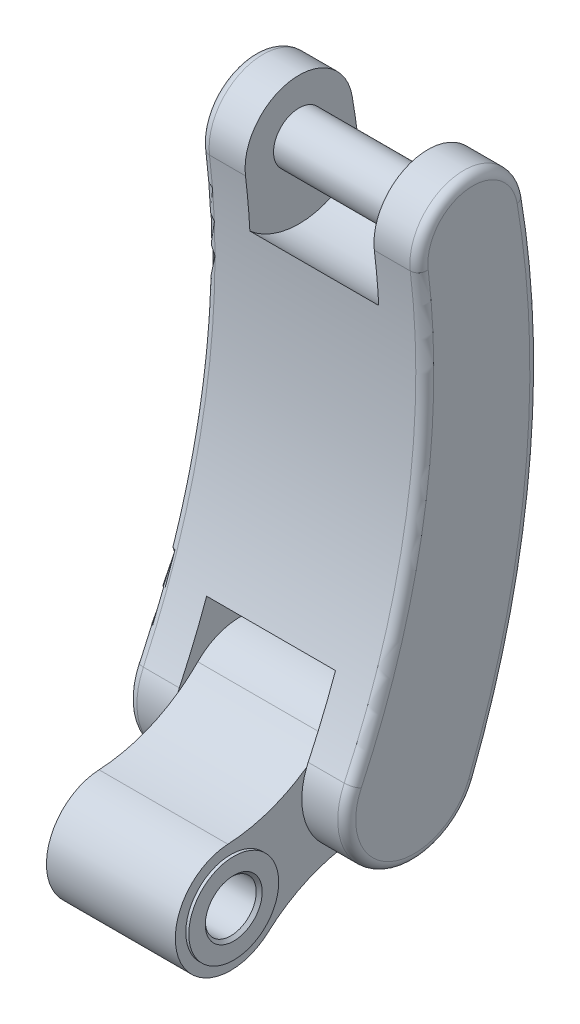
ISO-10303-21;
HEADER;
FILE_DESCRIPTION(('STEP AP214'),'2;1');
FILE_NAME('part.step','',(''),(''),'','','');
FILE_SCHEMA(('AUTOMOTIVE_DESIGN { 1 0 10303 214 1 1 1 1 }'));
ENDSEC;
DATA;
#1=APPLICATION_CONTEXT('core data for automotive mechanical design processes');
#2=APPLICATION_PROTOCOL_DEFINITION('international standard','automotive_design',2000,#1);
#3=PRODUCT_CONTEXT('',#1,'mechanical');
#4=PRODUCT('Part','Part','',(#3));
#5=PRODUCT_RELATED_PRODUCT_CATEGORY('part','',(#4));
#6=PRODUCT_DEFINITION_FORMATION('','',#4);
#7=PRODUCT_DEFINITION_CONTEXT('part definition',#1,'design');
#8=PRODUCT_DEFINITION('design','',#6,#7);
#9=PRODUCT_DEFINITION_SHAPE('','',#8);
#10=(LENGTH_UNIT() NAMED_UNIT(*) SI_UNIT(.MILLI.,.METRE.));
#11=(NAMED_UNIT(*) PLANE_ANGLE_UNIT() SI_UNIT($,.RADIAN.));
#12=(NAMED_UNIT(*) SI_UNIT($,.STERADIAN.) SOLID_ANGLE_UNIT());
#13=UNCERTAINTY_MEASURE_WITH_UNIT(LENGTH_MEASURE(1.E-05),#10,'distance_accuracy_value','');
#14=(GEOMETRIC_REPRESENTATION_CONTEXT(3) GLOBAL_UNCERTAINTY_ASSIGNED_CONTEXT((#13)) GLOBAL_UNIT_ASSIGNED_CONTEXT((#10,
#11,#12)) REPRESENTATION_CONTEXT('',''));
#15=CARTESIAN_POINT('',(0.,0.,0.));
#16=DIRECTION('',(0.,0.,1.));
#17=DIRECTION('',(1.,0.,0.));
#18=AXIS2_PLACEMENT_3D('',#15,#16,#17);
#19=CARTESIAN_POINT('',(-107.5,386.346733479078,385.154372171005));
#20=DIRECTION('',(-1.,0.,0.));
#21=DIRECTION('',(0.,0.,1.));
#22=AXIS2_PLACEMENT_3D('',#19,#20,#21);
#23=PLANE('',#22);
#24=CARTESIAN_POINT('',(-107.5,839.25450412163,-328.864527292864));
#25=DIRECTION('',(-1.,0.,0.));
#26=DIRECTION('',(0.,0.,1.));
#27=AXIS2_PLACEMENT_3D('',#24,#25,#26);
#28=CIRCLE('',#27,42.5000000000001);
#29=CARTESIAN_POINT('',(-107.5,839.25450412163,-371.364527292864));
#30=VERTEX_POINT('',#29);
#31=EDGE_CURVE('E11',#30,#30,#28,.F.);
#32=ORIENTED_EDGE('',*,*,#31,.F.);
#33=EDGE_LOOP('',(#32));
#34=FACE_BOUND('',#33,.T.);
#35=CARTESIAN_POINT('',(-107.5,839.25450412163,-328.864527292864));
#36=DIRECTION('',(-1.,0.,0.));
#37=DIRECTION('',(0.,0.,1.));
#38=AXIS2_PLACEMENT_3D('',#35,#36,#37);
#39=CIRCLE('',#38,125.);
#40=CARTESIAN_POINT('',(-107.5,744.898412841049,-246.877162179386));
#41=VERTEX_POINT('',#40);
#42=CARTESIAN_POINT('',(-107.5,765.815935458155,-430.016772115507));
#43=VERTEX_POINT('',#42);
#44=EDGE_CURVE('E51',#41,#43,#39,.F.);
#45=ORIENTED_EDGE('',*,*,#44,.T.);
#46=CARTESIAN_POINT('',(-107.5,601.669878834398,1060.9748684026));
#47=DIRECTION('',(-1.,0.,0.));
#48=DIRECTION('',(0.,0.,1.));
#49=AXIS2_PLACEMENT_3D('',#46,#47,#48);
#50=CIRCLE('',#49,1500.);
#51=CARTESIAN_POINT('',(-107.5,854.419480203794,-417.577680209595));
#52=VERTEX_POINT('',#51);
#53=EDGE_CURVE('E214',#52,#43,#50,.T.);
#54=ORIENTED_EDGE('',*,*,#53,.F.);
#55=CARTESIAN_POINT('',(-107.5,839.25450412163,-328.864527292864));
#56=DIRECTION('',(-1.,0.,0.));
#57=DIRECTION('',(0.,0.,1.));
#58=AXIS2_PLACEMENT_3D('',#55,#56,#57);
#59=CIRCLE('',#58,90.0000000000002);
#60=CARTESIAN_POINT('',(-107.5,828.358332052281,-239.526554211787));
#61=VERTEX_POINT('',#60);
#62=EDGE_CURVE('E205',#61,#52,#59,.T.);
#63=ORIENTED_EDGE('',*,*,#62,.F.);
#64=CARTESIAN_POINT('',(-107.5,677.022608866883,1001.27862746983));
#65=DIRECTION('',(1.,0.,0.));
#66=DIRECTION('',(0.,0.,1.));
#67=AXIS2_PLACEMENT_3D('',#64,#65,#66);
#68=CIRCLE('',#67,1250.);
#69=EDGE_CURVE('E206',#41,#61,#68,.T.);
#70=ORIENTED_EDGE('',*,*,#69,.F.);
#71=EDGE_LOOP('',(#45,#54,#63,#70));
#72=FACE_BOUND('',#71,.T.);
#73=ADVANCED_FACE('F36',(#34,#72),#23,.F.);
#74=CARTESIAN_POINT('',(-107.5,95.6708580912726,-230.969883127822));
#75=DIRECTION('',(-1.,0.,0.));
#76=DIRECTION('',(0.,0.,1.));
#77=AXIS2_PLACEMENT_3D('',#74,#75,#76);
#78=CIRCLE('',#77,167.5);
#79=CARTESIAN_POINT('',(-107.5,176.700112622026,-377.566301604504));
#80=VERTEX_POINT('',#79);
#81=CARTESIAN_POINT('',(-107.5,253.462244011743,-174.772654287806));
#82=VERTEX_POINT('',#81);
#83=EDGE_CURVE('E185',#80,#82,#78,.F.);
#84=ORIENTED_EDGE('',*,*,#83,.T.);
#85=CARTESIAN_POINT('',(-107.5,143.672378797516,-129.22459326196));
#86=VERTEX_POINT('',#85);
#87=EDGE_CURVE('E195',#86,#82,#68,.T.);
#88=ORIENTED_EDGE('',*,*,#87,.F.);
#89=CARTESIAN_POINT('',(-107.5,95.6708580912726,-230.969883127822));
#90=DIRECTION('',(-1.,0.,0.));
#91=DIRECTION('',(0.,0.,1.));
#92=AXIS2_PLACEMENT_3D('',#89,#90,#91);
#93=CIRCLE('',#92,112.5);
#94=CARTESIAN_POINT('',(-107.5,137.914499390301,-126.702319764141));
#95=VERTEX_POINT('',#94);
#96=EDGE_CURVE('E217',#95,#86,#93,.T.);
#97=ORIENTED_EDGE('',*,*,#96,.F.);
#98=CARTESIAN_POINT('',(-107.5,342.04623449669,17.6245132311651));
#99=DIRECTION('',(-1.,0.,0.));
#100=DIRECTION('',(0.,0.,1.));
#101=AXIS2_PLACEMENT_3D('',#98,#99,#100);
#102=CIRCLE('',#101,250.);
#103=CARTESIAN_POINT('',(-107.5,166.063822778535,-159.94291273954));
#104=VERTEX_POINT('',#103);
#105=EDGE_CURVE('E256',#104,#95,#102,.T.);
#106=ORIENTED_EDGE('',*,*,#105,.F.);
#107=CARTESIAN_POINT('',(-107.5,95.6708580912726,-230.969883127822));
#108=DIRECTION('',(1.,0.,0.));
#109=DIRECTION('',(0.,0.,-1.));
#110=AXIS2_PLACEMENT_3D('',#107,#108,#109);
#111=CIRCLE('',#110,100.);
#112=CARTESIAN_POINT('',(-107.5,-4.32813699560582,-230.52157339732));
#113=VERTEX_POINT('',#112);
#114=EDGE_CURVE('E264',#113,#104,#111,.T.);
#115=ORIENTED_EDGE('',*,*,#114,.F.);
#116=CARTESIAN_POINT('',(-107.5,-254.325624712802,-229.400799071065));
#117=DIRECTION('',(-1.,0.,0.));
#118=DIRECTION('',(0.,0.,1.));
#119=AXIS2_PLACEMENT_3D('',#116,#117,#118);
#120=CIRCLE('',#119,250.);
#121=CARTESIAN_POINT('',(-107.5,-7.92820824553882,-187.11234724012));
#122=VERTEX_POINT('',#121);
#123=EDGE_CURVE('E231',#113,#122,#120,.F.);
#124=ORIENTED_EDGE('',*,*,#123,.T.);
#125=CARTESIAN_POINT('',(-107.5,54.6439104634516,-335.722160278937));
#126=VERTEX_POINT('',#125);
#127=EDGE_CURVE('E218',#126,#122,#93,.T.);
#128=ORIENTED_EDGE('',*,*,#127,.F.);
#129=EDGE_CURVE('E197',#80,#126,#50,.T.);
#130=ORIENTED_EDGE('',*,*,#129,.F.);
#131=EDGE_LOOP('',(#84,#88,#97,#106,#115,#124,#128,#130));
#132=FACE_BOUND('',#131,.T.);
#133=ADVANCED_FACE('F194',(#132),#23,.F.);
#134=CARTESIAN_POINT('',(107.5,348.670368462836,415.002492637388));
#135=DIRECTION('',(1.,0.,0.));
#136=DIRECTION('',(0.,0.,-1.));
#137=AXIS2_PLACEMENT_3D('',#134,#135,#136);
#138=PLANE('',#137);
#139=CARTESIAN_POINT('',(107.5,839.25450412163,-328.864527292864));
#140=DIRECTION('',(1.,0.,0.));
#141=DIRECTION('',(0.,0.,-1.));
#142=AXIS2_PLACEMENT_3D('',#139,#140,#141);
#143=CIRCLE('',#142,42.5000000000001);
#144=CARTESIAN_POINT('',(107.5,839.25450412163,-371.364527292864));
#145=VERTEX_POINT('',#144);
#146=EDGE_CURVE('E44',#145,#145,#143,.F.);
#147=ORIENTED_EDGE('',*,*,#146,.F.);
#148=EDGE_LOOP('',(#147));
#149=FACE_BOUND('',#148,.T.);
#150=CARTESIAN_POINT('',(107.5,839.25450412163,-328.864527292864));
#151=DIRECTION('',(1.,0.,0.));
#152=DIRECTION('',(0.,0.,1.));
#153=AXIS2_PLACEMENT_3D('',#150,#151,#152);
#154=CIRCLE('',#153,125.);
#155=CARTESIAN_POINT('',(107.5,744.898412841049,-246.877162179386));
#156=VERTEX_POINT('',#155);
#157=CARTESIAN_POINT('',(107.5,765.815935458155,-430.016772115507));
#158=VERTEX_POINT('',#157);
#159=EDGE_CURVE('E363',#156,#158,#154,.T.);
#160=ORIENTED_EDGE('',*,*,#159,.F.);
#161=CARTESIAN_POINT('',(107.5,677.022608866883,1001.27862746983));
#162=DIRECTION('',(-1.,0.,0.));
#163=DIRECTION('',(0.,0.,-1.));
#164=AXIS2_PLACEMENT_3D('',#161,#162,#163);
#165=CIRCLE('',#164,1250.);
#166=CARTESIAN_POINT('',(107.5,828.358332052281,-239.526554211787));
#167=VERTEX_POINT('',#166);
#168=EDGE_CURVE('E366',#167,#156,#165,.T.);
#169=ORIENTED_EDGE('',*,*,#168,.F.);
#170=CARTESIAN_POINT('',(107.5,839.25450412163,-328.864527292864));
#171=DIRECTION('',(1.,0.,0.));
#172=DIRECTION('',(0.,0.,-1.));
#173=AXIS2_PLACEMENT_3D('',#170,#171,#172);
#174=CIRCLE('',#173,90.0000000000004);
#175=CARTESIAN_POINT('',(107.5,854.419480203794,-417.577680209596));
#176=VERTEX_POINT('',#175);
#177=EDGE_CURVE('E380',#176,#167,#174,.T.);
#178=ORIENTED_EDGE('',*,*,#177,.F.);
#179=CARTESIAN_POINT('',(107.5,601.669878834398,1060.9748684026));
#180=DIRECTION('',(1.,0.,0.));
#181=DIRECTION('',(0.,0.,-1.));
#182=AXIS2_PLACEMENT_3D('',#179,#180,#181);
#183=CIRCLE('',#182,1500.);
#184=EDGE_CURVE('E367',#158,#176,#183,.T.);
#185=ORIENTED_EDGE('',*,*,#184,.F.);
#186=EDGE_LOOP('',(#160,#169,#178,#185));
#187=FACE_BOUND('',#186,.T.);
#188=ADVANCED_FACE('F354',(#149,#187),#138,.F.);
#189=CARTESIAN_POINT('',(107.5,95.6708580912726,-230.969883127822));
#190=DIRECTION('',(1.,0.,0.));
#191=DIRECTION('',(0.,0.,1.));
#192=AXIS2_PLACEMENT_3D('',#189,#190,#191);
#193=CIRCLE('',#192,167.5);
#194=CARTESIAN_POINT('',(107.5,176.700112622026,-377.566301604504));
#195=VERTEX_POINT('',#194);
#196=CARTESIAN_POINT('',(107.5,253.462244011743,-174.772654287806));
#197=VERTEX_POINT('',#196);
#198=EDGE_CURVE('E59',#195,#197,#193,.T.);
#199=ORIENTED_EDGE('',*,*,#198,.F.);
#200=CARTESIAN_POINT('',(107.5,54.6439104634512,-335.722160278937));
#201=VERTEX_POINT('',#200);
#202=EDGE_CURVE('E435',#201,#195,#183,.T.);
#203=ORIENTED_EDGE('',*,*,#202,.F.);
#204=CARTESIAN_POINT('',(107.5,95.6708580912726,-230.969883127822));
#205=DIRECTION('',(1.,0.,0.));
#206=DIRECTION('',(0.,0.,-1.));
#207=AXIS2_PLACEMENT_3D('',#204,#205,#206);
#208=CIRCLE('',#207,112.5);
#209=CARTESIAN_POINT('',(107.5,-7.92820824553886,-187.11234724012));
#210=VERTEX_POINT('',#209);
#211=EDGE_CURVE('E340',#210,#201,#208,.T.);
#212=ORIENTED_EDGE('',*,*,#211,.F.);
#213=CARTESIAN_POINT('',(107.5,-254.325624712802,-229.400799071065));
#214=DIRECTION('',(1.,0.,0.));
#215=DIRECTION('',(0.,0.,-1.));
#216=AXIS2_PLACEMENT_3D('',#213,#214,#215);
#217=CIRCLE('',#216,250.);
#218=CARTESIAN_POINT('',(107.5,-4.32813699560582,-230.52157339732));
#219=VERTEX_POINT('',#218);
#220=EDGE_CURVE('E210',#210,#219,#217,.F.);
#221=ORIENTED_EDGE('',*,*,#220,.T.);
#222=CARTESIAN_POINT('',(107.5,95.6708580912726,-230.969883127822));
#223=DIRECTION('',(1.,0.,0.));
#224=DIRECTION('',(0.,0.,-1.));
#225=AXIS2_PLACEMENT_3D('',#222,#223,#224);
#226=CIRCLE('',#225,100.);
#227=CARTESIAN_POINT('',(107.5,166.063822778535,-159.94291273954));
#228=VERTEX_POINT('',#227);
#229=EDGE_CURVE('E252',#219,#228,#226,.T.);
#230=ORIENTED_EDGE('',*,*,#229,.T.);
#231=CARTESIAN_POINT('',(107.5,342.04623449669,17.6245132311651));
#232=DIRECTION('',(-1.,0.,0.));
#233=DIRECTION('',(0.,0.,1.));
#234=AXIS2_PLACEMENT_3D('',#231,#232,#233);
#235=CIRCLE('',#234,250.);
#236=CARTESIAN_POINT('',(107.5,137.914499390301,-126.702319764141));
#237=VERTEX_POINT('',#236);
#238=EDGE_CURVE('E243',#228,#237,#235,.T.);
#239=ORIENTED_EDGE('',*,*,#238,.T.);
#240=CARTESIAN_POINT('',(107.5,143.672378797516,-129.22459326196));
#241=VERTEX_POINT('',#240);
#242=EDGE_CURVE('E430',#241,#237,#208,.T.);
#243=ORIENTED_EDGE('',*,*,#242,.F.);
#244=EDGE_CURVE('E376',#197,#241,#165,.T.);
#245=ORIENTED_EDGE('',*,*,#244,.F.);
#246=EDGE_LOOP('',(#199,#203,#212,#221,#230,#239,#243,#245));
#247=FACE_BOUND('',#246,.T.);
#248=ADVANCED_FACE('F357',(#247),#138,.F.);
#249=CARTESIAN_POINT('',(-107.5,171.023117248345,8.81225661558254));
#250=DIRECTION('',(-1.,0.,0.));
#251=DIRECTION('',(0.,0.,1.));
#252=AXIS2_PLACEMENT_3D('',#249,#250,#251);
#253=PLANE('',#252);
#254=CARTESIAN_POINT('',(-107.5,92.3774501925367,4.75990503323437));
#255=VERTEX_POINT('',#254);
#256=EDGE_CURVE('E242',#95,#255,#102,.T.);
#257=ORIENTED_EDGE('',*,*,#256,.F.);
#258=EDGE_CURVE('E221',#122,#95,#93,.T.);
#259=ORIENTED_EDGE('',*,*,#258,.F.);
#260=CARTESIAN_POINT('',(-107.5,-254.325624712802,-229.400799071065));
#261=DIRECTION('',(-1.,0.,0.));
#262=DIRECTION('',(0.,0.,1.));
#263=AXIS2_PLACEMENT_3D('',#260,#261,#262);
#264=CIRCLE('',#263,250.);
#265=CARTESIAN_POINT('',(-107.5,-68.6864825866692,-61.9549603330613));
#266=VERTEX_POINT('',#265);
#267=EDGE_CURVE('E261',#266,#122,#264,.T.);
#268=ORIENTED_EDGE('',*,*,#267,.F.);
#269=CARTESIAN_POINT('',(-107.5,0.,0.));
#270=DIRECTION('',(1.,0.,0.));
#271=DIRECTION('',(0.,0.,-1.));
#272=AXIS2_PLACEMENT_3D('',#269,#270,#271);
#273=CIRCLE('',#272,92.5);
#274=EDGE_CURVE('E259',#255,#266,#273,.T.);
#275=ORIENTED_EDGE('',*,*,#274,.F.);
#276=EDGE_LOOP('',(#257,#259,#268,#275));
#277=FACE_BOUND('',#276,.T.);
#278=CARTESIAN_POINT('',(-107.5,0.,0.));
#279=DIRECTION('',(-1.,0.,0.));
#280=DIRECTION('',(0.,0.,1.));
#281=AXIS2_PLACEMENT_3D('',#278,#279,#280);
#282=CIRCLE('',#281,75.);
#283=CARTESIAN_POINT('',(-107.5,0.,75.));
#284=VERTEX_POINT('',#283);
#285=EDGE_CURVE('E233',#284,#284,#282,.T.);
#286=ORIENTED_EDGE('',*,*,#285,.F.);
#287=EDGE_LOOP('',(#286));
#288=FACE_BOUND('',#287,.T.);
#289=ADVANCED_FACE('F417',(#277,#288),#253,.T.);
#290=CARTESIAN_POINT('',(107.5,171.023117248345,8.81225661558254));
#291=DIRECTION('',(-1.,0.,0.));
#292=DIRECTION('',(0.,0.,1.));
#293=AXIS2_PLACEMENT_3D('',#290,#291,#292);
#294=PLANE('',#293);
#295=EDGE_CURVE('E405',#237,#210,#208,.T.);
#296=ORIENTED_EDGE('',*,*,#295,.F.);
#297=CARTESIAN_POINT('',(107.5,92.3774501925367,4.75990503323437));
#298=VERTEX_POINT('',#297);
#299=EDGE_CURVE('E247',#237,#298,#235,.T.);
#300=ORIENTED_EDGE('',*,*,#299,.T.);
#301=CARTESIAN_POINT('',(107.5,0.,0.));
#302=DIRECTION('',(1.,0.,0.));
#303=DIRECTION('',(0.,0.,-1.));
#304=AXIS2_PLACEMENT_3D('',#301,#302,#303);
#305=CIRCLE('',#304,92.5);
#306=CARTESIAN_POINT('',(107.5,-68.6864825866692,-61.9549603330613));
#307=VERTEX_POINT('',#306);
#308=EDGE_CURVE('E246',#298,#307,#305,.T.);
#309=ORIENTED_EDGE('',*,*,#308,.T.);
#310=CARTESIAN_POINT('',(107.5,-254.325624712802,-229.400799071065));
#311=DIRECTION('',(-1.,0.,0.));
#312=DIRECTION('',(0.,0.,1.));
#313=AXIS2_PLACEMENT_3D('',#310,#311,#312);
#314=CIRCLE('',#313,250.);
#315=EDGE_CURVE('E249',#307,#210,#314,.T.);
#316=ORIENTED_EDGE('',*,*,#315,.T.);
#317=EDGE_LOOP('',(#296,#300,#309,#316));
#318=FACE_BOUND('',#317,.T.);
#319=CARTESIAN_POINT('',(107.5,0.,0.));
#320=DIRECTION('',(-1.,0.,0.));
#321=DIRECTION('',(0.,0.,1.));
#322=AXIS2_PLACEMENT_3D('',#319,#320,#321);
#323=CIRCLE('',#322,75.);
#324=CARTESIAN_POINT('',(107.5,0.,75.));
#325=VERTEX_POINT('',#324);
#326=EDGE_CURVE('E278',#325,#325,#323,.F.);
#327=ORIENTED_EDGE('',*,*,#326,.F.);
#328=EDGE_LOOP('',(#327));
#329=FACE_BOUND('',#328,.T.);
#330=ADVANCED_FACE('F403',(#318,#329),#294,.F.);
#331=CARTESIAN_POINT('',(107.5,342.04623449669,17.6245132311651));
#332=DIRECTION('',(-1.,0.,0.));
#333=DIRECTION('',(0.,0.,1.));
#334=AXIS2_PLACEMENT_3D('',#331,#332,#333);
#335=CYLINDRICAL_SURFACE('',#334,250.);
#336=ORIENTED_EDGE('',*,*,#105,.T.);
#337=ORIENTED_EDGE('',*,*,#256,.T.);
#338=DIRECTION('',(-1.,0.,0.));
#339=VECTOR('',#338,1.);
#340=CARTESIAN_POINT('',(107.5,92.3774501925367,4.75990503323437));
#341=LINE('',#340,#339);
#342=EDGE_CURVE('E275',#298,#255,#341,.T.);
#343=ORIENTED_EDGE('',*,*,#342,.F.);
#344=ORIENTED_EDGE('',*,*,#299,.F.);
#345=ORIENTED_EDGE('',*,*,#238,.F.);
#346=DIRECTION('',(-1.,0.,0.));
#347=VECTOR('',#346,1.);
#348=CARTESIAN_POINT('',(107.5,166.063822778535,-159.94291273954));
#349=LINE('',#348,#347);
#350=EDGE_CURVE('E255',#228,#104,#349,.T.);
#351=ORIENTED_EDGE('',*,*,#350,.T.);
#352=EDGE_LOOP('',(#336,#337,#343,#344,#345,#351));
#353=FACE_BOUND('',#352,.T.);
#354=ADVANCED_FACE('F427',(#353),#335,.F.);
#355=CARTESIAN_POINT('',(107.5,0.,0.));
#356=DIRECTION('',(-1.,0.,0.));
#357=DIRECTION('',(0.,0.,1.));
#358=AXIS2_PLACEMENT_3D('',#355,#356,#357);
#359=CYLINDRICAL_SURFACE('',#358,92.5);
#360=ORIENTED_EDGE('',*,*,#274,.T.);
#361=DIRECTION('',(-1.,0.,0.));
#362=VECTOR('',#361,1.);
#363=CARTESIAN_POINT('',(107.5,-68.6864825866692,-61.9549603330613));
#364=LINE('',#363,#362);
#365=EDGE_CURVE('E272',#307,#266,#364,.T.);
#366=ORIENTED_EDGE('',*,*,#365,.F.);
#367=ORIENTED_EDGE('',*,*,#308,.F.);
#368=ORIENTED_EDGE('',*,*,#342,.T.);
#369=EDGE_LOOP('',(#360,#366,#367,#368));
#370=FACE_BOUND('',#369,.T.);
#371=ADVANCED_FACE('F411',(#370),#359,.T.);
#372=CARTESIAN_POINT('',(107.5,-254.325624712802,-229.400799071065));
#373=DIRECTION('',(-1.,0.,0.));
#374=DIRECTION('',(0.,0.,1.));
#375=AXIS2_PLACEMENT_3D('',#372,#373,#374);
#376=CYLINDRICAL_SURFACE('',#375,250.);
#377=ORIENTED_EDGE('',*,*,#267,.T.);
#378=ORIENTED_EDGE('',*,*,#123,.F.);
#379=DIRECTION('',(-1.,0.,0.));
#380=VECTOR('',#379,1.);
#381=CARTESIAN_POINT('',(107.5,-4.32813699560582,-230.52157339732));
#382=LINE('',#381,#380);
#383=EDGE_CURVE('E269',#219,#113,#382,.T.);
#384=ORIENTED_EDGE('',*,*,#383,.F.);
#385=ORIENTED_EDGE('',*,*,#220,.F.);
#386=ORIENTED_EDGE('',*,*,#315,.F.);
#387=ORIENTED_EDGE('',*,*,#365,.T.);
#388=EDGE_LOOP('',(#377,#378,#384,#385,#386,#387));
#389=FACE_BOUND('',#388,.T.);
#390=ADVANCED_FACE('F400',(#389),#376,.F.);
#391=CARTESIAN_POINT('',(107.5,95.6708580912726,-230.969883127822));
#392=DIRECTION('',(-1.,0.,0.));
#393=DIRECTION('',(0.,0.,1.));
#394=AXIS2_PLACEMENT_3D('',#391,#392,#393);
#395=CYLINDRICAL_SURFACE('',#394,100.);
#396=ORIENTED_EDGE('',*,*,#114,.T.);
#397=ORIENTED_EDGE('',*,*,#350,.F.);
#398=ORIENTED_EDGE('',*,*,#229,.F.);
#399=ORIENTED_EDGE('',*,*,#383,.T.);
#400=EDGE_LOOP('',(#396,#397,#398,#399));
#401=FACE_BOUND('',#400,.T.);
#402=ADVANCED_FACE('F426',(#401),#395,.T.);
#403=CARTESIAN_POINT('',(107.5,0.,0.));
#404=DIRECTION('',(-1.,0.,0.));
#405=DIRECTION('',(0.,0.,1.));
#406=AXIS2_PLACEMENT_3D('',#403,#404,#405);
#407=CYLINDRICAL_SURFACE('',#406,42.5);
#408=CARTESIAN_POINT('',(-107.5,0.,0.));
#409=DIRECTION('',(-1.,0.,0.));
#410=DIRECTION('',(0.,0.,1.));
#411=AXIS2_PLACEMENT_3D('',#408,#409,#410);
#412=CIRCLE('',#411,42.5);
#413=CARTESIAN_POINT('',(-107.5,0.,42.5));
#414=VERTEX_POINT('',#413);
#415=EDGE_CURVE('E284',#414,#414,#412,.T.);
#416=ORIENTED_EDGE('',*,*,#415,.T.);
#417=EDGE_LOOP('',(#416));
#418=FACE_BOUND('',#417,.T.);
#419=CARTESIAN_POINT('',(107.5,0.,0.));
#420=DIRECTION('',(1.,0.,0.));
#421=DIRECTION('',(0.,0.,-1.));
#422=AXIS2_PLACEMENT_3D('',#419,#420,#421);
#423=CIRCLE('',#422,42.5);
#424=CARTESIAN_POINT('',(107.5,0.,-42.5));
#425=VERTEX_POINT('',#424);
#426=EDGE_CURVE('E281',#425,#425,#423,.T.);
#427=ORIENTED_EDGE('',*,*,#426,.T.);
#428=EDGE_LOOP('',(#427));
#429=FACE_BOUND('',#428,.T.);
#430=ADVANCED_FACE('F509',(#418,#429),#407,.F.);
#431=CARTESIAN_POINT('',(112.5,0.,0.));
#432=DIRECTION('',(1.,0.,0.));
#433=DIRECTION('',(0.,0.,-1.));
#434=AXIS2_PLACEMENT_3D('',#431,#432,#433);
#435=PLANE('',#434);
#436=CARTESIAN_POINT('',(112.5,0.,0.));
#437=DIRECTION('',(1.,0.,0.));
#438=DIRECTION('',(0.,0.,-1.));
#439=AXIS2_PLACEMENT_3D('',#436,#437,#438);
#440=CIRCLE('',#439,47.4999999999999);
#441=CARTESIAN_POINT('',(112.5,0.,-47.4999999999999));
#442=VERTEX_POINT('',#441);
#443=EDGE_CURVE('E290',#442,#442,#440,.F.);
#444=ORIENTED_EDGE('',*,*,#443,.T.);
#445=EDGE_LOOP('',(#444));
#446=FACE_BOUND('',#445,.T.);
#447=CARTESIAN_POINT('',(112.5,0.,0.));
#448=DIRECTION('',(1.,0.,0.));
#449=DIRECTION('',(0.,0.,-1.));
#450=AXIS2_PLACEMENT_3D('',#447,#448,#449);
#451=CIRCLE('',#450,75.);
#452=CARTESIAN_POINT('',(112.5,0.,-75.));
#453=VERTEX_POINT('',#452);
#454=EDGE_CURVE('E237',#453,#453,#451,.T.);
#455=ORIENTED_EDGE('',*,*,#454,.T.);
#456=EDGE_LOOP('',(#455));
#457=FACE_BOUND('',#456,.T.);
#458=ADVANCED_FACE('F506',(#446,#457),#435,.T.);
#459=CARTESIAN_POINT('',(112.5,0.,0.));
#460=DIRECTION('',(-1.,0.,0.));
#461=DIRECTION('',(0.,0.,1.));
#462=AXIS2_PLACEMENT_3D('',#459,#460,#461);
#463=CYLINDRICAL_SURFACE('',#462,75.);
#464=ORIENTED_EDGE('',*,*,#454,.F.);
#465=EDGE_LOOP('',(#464));
#466=FACE_BOUND('',#465,.T.);
#467=ORIENTED_EDGE('',*,*,#326,.T.);
#468=EDGE_LOOP('',(#467));
#469=FACE_BOUND('',#468,.T.);
#470=ADVANCED_FACE('F500',(#466,#469),#463,.T.);
#471=CARTESIAN_POINT('',(-112.5,0.,0.));
#472=DIRECTION('',(-1.,0.,0.));
#473=DIRECTION('',(0.,0.,1.));
#474=AXIS2_PLACEMENT_3D('',#471,#472,#473);
#475=PLANE('',#474);
#476=CARTESIAN_POINT('',(-112.5,0.,0.));
#477=DIRECTION('',(-1.,0.,0.));
#478=DIRECTION('',(0.,0.,1.));
#479=AXIS2_PLACEMENT_3D('',#476,#477,#478);
#480=CIRCLE('',#479,47.4999999999999);
#481=CARTESIAN_POINT('',(-112.5,0.,47.4999999999999));
#482=VERTEX_POINT('',#481);
#483=EDGE_CURVE('E287',#482,#482,#480,.F.);
#484=ORIENTED_EDGE('',*,*,#483,.T.);
#485=EDGE_LOOP('',(#484));
#486=FACE_BOUND('',#485,.T.);
#487=CARTESIAN_POINT('',(-112.5,0.,0.));
#488=DIRECTION('',(-1.,0.,0.));
#489=DIRECTION('',(0.,0.,1.));
#490=AXIS2_PLACEMENT_3D('',#487,#488,#489);
#491=CIRCLE('',#490,75.);
#492=CARTESIAN_POINT('',(-112.5,0.,75.));
#493=VERTEX_POINT('',#492);
#494=EDGE_CURVE('E234',#493,#493,#491,.T.);
#495=ORIENTED_EDGE('',*,*,#494,.T.);
#496=EDGE_LOOP('',(#495));
#497=FACE_BOUND('',#496,.T.);
#498=ADVANCED_FACE('F496',(#486,#497),#475,.T.);
#499=CARTESIAN_POINT('',(-112.5,0.,0.));
#500=DIRECTION('',(1.,0.,0.));
#501=DIRECTION('',(0.,0.,-1.));
#502=AXIS2_PLACEMENT_3D('',#499,#500,#501);
#503=CYLINDRICAL_SURFACE('',#502,75.);
#504=ORIENTED_EDGE('',*,*,#494,.F.);
#505=EDGE_LOOP('',(#504));
#506=FACE_BOUND('',#505,.T.);
#507=ORIENTED_EDGE('',*,*,#285,.T.);
#508=EDGE_LOOP('',(#507));
#509=FACE_BOUND('',#508,.T.);
#510=ADVANCED_FACE('F499',(#506,#509),#503,.T.);
#511=CARTESIAN_POINT('',(-107.5,0.,0.));
#512=DIRECTION('',(-1.,0.,0.));
#513=DIRECTION('',(0.,0.,1.));
#514=AXIS2_PLACEMENT_3D('',#511,#512,#513);
#515=CONICAL_SURFACE('',#514,42.5,0.785398163397446);
#516=ORIENTED_EDGE('',*,*,#483,.F.);
#517=EDGE_LOOP('',(#516));
#518=FACE_BOUND('',#517,.T.);
#519=ORIENTED_EDGE('',*,*,#415,.F.);
#520=EDGE_LOOP('',(#519));
#521=FACE_BOUND('',#520,.T.);
#522=ADVANCED_FACE('F504',(#518,#521),#515,.F.);
#523=CARTESIAN_POINT('',(107.5,0.,0.));
#524=DIRECTION('',(1.,0.,0.));
#525=DIRECTION('',(0.,0.,-1.));
#526=AXIS2_PLACEMENT_3D('',#523,#524,#525);
#527=CONICAL_SURFACE('',#526,42.5,0.785398163397446);
#528=ORIENTED_EDGE('',*,*,#443,.F.);
#529=EDGE_LOOP('',(#528));
#530=FACE_BOUND('',#529,.T.);
#531=ORIENTED_EDGE('',*,*,#426,.F.);
#532=EDGE_LOOP('',(#531));
#533=FACE_BOUND('',#532,.T.);
#534=ADVANCED_FACE('F495',(#530,#533),#527,.F.);
#535=CARTESIAN_POINT('',(-182.5,677.022608866883,1001.27862746983));
#536=DIRECTION('',(1.,0.,0.));
#537=DIRECTION('',(0.,0.,-1.));
#538=AXIS2_PLACEMENT_3D('',#535,#536,#537);
#539=CYLINDRICAL_SURFACE('',#538,1250.);
#540=DIRECTION('',(1.,0.,0.));
#541=VECTOR('',#540,1.);
#542=CARTESIAN_POINT('',(-182.5,828.358332052281,-239.526554211787));
#543=LINE('',#542,#541);
#544=CARTESIAN_POINT('',(-167.5,828.358332052281,-239.526554211787));
#545=VERTEX_POINT('',#544);
#546=EDGE_CURVE('E228',#545,#61,#543,.T.);
#547=ORIENTED_EDGE('',*,*,#546,.F.);
#548=CARTESIAN_POINT('',(-167.5,677.022608866883,1001.27862746983));
#549=DIRECTION('',(-1.,0.,0.));
#550=DIRECTION('',(0.,0.,1.));
#551=AXIS2_PLACEMENT_3D('',#548,#549,#550);
#552=CIRCLE('',#551,1250.);
#553=CARTESIAN_POINT('',(-167.5,143.672378797516,-129.22459326196));
#554=VERTEX_POINT('',#553);
#555=EDGE_CURVE('E309',#545,#554,#552,.T.);
#556=ORIENTED_EDGE('',*,*,#555,.T.);
#557=DIRECTION('',(1.,0.,0.));
#558=VECTOR('',#557,1.);
#559=CARTESIAN_POINT('',(-182.5,143.672378797516,-129.22459326196));
#560=LINE('',#559,#558);
#561=EDGE_CURVE('E203',#554,#86,#560,.T.);
#562=ORIENTED_EDGE('',*,*,#561,.T.);
#563=ORIENTED_EDGE('',*,*,#87,.T.);
#564=DIRECTION('',(1.,0.,0.));
#565=VECTOR('',#564,1.);
#566=CARTESIAN_POINT('',(-753.167735356312,253.462244011743,-174.772654287806));
#567=LINE('',#566,#565);
#568=EDGE_CURVE('E182',#82,#197,#567,.T.);
#569=ORIENTED_EDGE('',*,*,#568,.T.);
#570=ORIENTED_EDGE('',*,*,#244,.T.);
#571=DIRECTION('',(-1.,0.,0.));
#572=VECTOR('',#571,1.);
#573=CARTESIAN_POINT('',(182.5,143.672378797516,-129.22459326196));
#574=LINE('',#573,#572);
#575=CARTESIAN_POINT('',(167.5,143.672378797516,-129.22459326196));
#576=VERTEX_POINT('',#575);
#577=EDGE_CURVE('E375',#576,#241,#574,.T.);
#578=ORIENTED_EDGE('',*,*,#577,.F.);
#579=CARTESIAN_POINT('',(167.5,677.022608866883,1001.27862746983));
#580=DIRECTION('',(1.,0.,0.));
#581=DIRECTION('',(0.,0.,-1.));
#582=AXIS2_PLACEMENT_3D('',#579,#580,#581);
#583=CIRCLE('',#582,1250.);
#584=CARTESIAN_POINT('',(167.5,828.358332052281,-239.526554211787));
#585=VERTEX_POINT('',#584);
#586=EDGE_CURVE('E320',#576,#585,#583,.T.);
#587=ORIENTED_EDGE('',*,*,#586,.T.);
#588=DIRECTION('',(-1.,0.,0.));
#589=VECTOR('',#588,1.);
#590=CARTESIAN_POINT('',(182.5,828.358332052281,-239.526554211787));
#591=LINE('',#590,#589);
#592=EDGE_CURVE('E373',#585,#167,#591,.T.);
#593=ORIENTED_EDGE('',*,*,#592,.T.);
#594=ORIENTED_EDGE('',*,*,#168,.T.);
#595=DIRECTION('',(1.,0.,0.));
#596=VECTOR('',#595,1.);
#597=CARTESIAN_POINT('',(-753.167735356312,744.898412841049,-246.877162179386));
#598=LINE('',#597,#596);
#599=EDGE_CURVE('E369',#41,#156,#598,.T.);
#600=ORIENTED_EDGE('',*,*,#599,.F.);
#601=ORIENTED_EDGE('',*,*,#69,.T.);
#602=EDGE_LOOP('',(#547,#556,#562,#563,#569,#570,#578,#587,#593,#594,#600,#601));
#603=FACE_BOUND('',#602,.T.);
#604=ADVANCED_FACE('F201',(#603),#539,.F.);
#605=CARTESIAN_POINT('',(-182.5,839.25450412163,-328.864527292864));
#606=DIRECTION('',(1.,0.,0.));
#607=DIRECTION('',(0.,0.,-1.));
#608=AXIS2_PLACEMENT_3D('',#605,#606,#607);
#609=CYLINDRICAL_SURFACE('',#608,90.0000000000002);
#610=DIRECTION('',(1.,0.,0.));
#611=VECTOR('',#610,1.);
#612=CARTESIAN_POINT('',(-182.5,854.419480203794,-417.577680209595));
#613=LINE('',#612,#611);
#614=CARTESIAN_POINT('',(-167.5,854.419480203794,-417.577680209595));
#615=VERTEX_POINT('',#614);
#616=EDGE_CURVE('E226',#615,#52,#613,.T.);
#617=ORIENTED_EDGE('',*,*,#616,.F.);
#618=CARTESIAN_POINT('',(-167.5,839.25450412163,-328.864527292864));
#619=DIRECTION('',(-1.,0.,0.));
#620=DIRECTION('',(0.,0.,1.));
#621=AXIS2_PLACEMENT_3D('',#618,#619,#620);
#622=CIRCLE('',#621,90.0000000000002);
#623=EDGE_CURVE('E307',#615,#545,#622,.F.);
#624=ORIENTED_EDGE('',*,*,#623,.T.);
#625=ORIENTED_EDGE('',*,*,#546,.T.);
#626=ORIENTED_EDGE('',*,*,#62,.T.);
#627=EDGE_LOOP('',(#617,#624,#625,#626));
#628=FACE_BOUND('',#627,.T.);
#629=ADVANCED_FACE('F489',(#628),#609,.T.);
#630=CARTESIAN_POINT('',(-182.5,601.669878834398,1060.9748684026));
#631=DIRECTION('',(1.,0.,0.));
#632=DIRECTION('',(0.,0.,-1.));
#633=AXIS2_PLACEMENT_3D('',#630,#631,#632);
#634=CYLINDRICAL_SURFACE('',#633,1500.);
#635=DIRECTION('',(1.,0.,0.));
#636=VECTOR('',#635,1.);
#637=CARTESIAN_POINT('',(-182.5,54.6439104634516,-335.722160278937));
#638=LINE('',#637,#636);
#639=CARTESIAN_POINT('',(-167.5,54.6439104634516,-335.722160278937));
#640=VERTEX_POINT('',#639);
#641=EDGE_CURVE('E223',#640,#126,#638,.T.);
#642=ORIENTED_EDGE('',*,*,#641,.F.);
#643=CARTESIAN_POINT('',(-167.5,601.669878834398,1060.9748684026));
#644=DIRECTION('',(-1.,0.,0.));
#645=DIRECTION('',(0.,0.,1.));
#646=AXIS2_PLACEMENT_3D('',#643,#644,#645);
#647=CIRCLE('',#646,1500.);
#648=EDGE_CURVE('E305',#640,#615,#647,.F.);
#649=ORIENTED_EDGE('',*,*,#648,.T.);
#650=ORIENTED_EDGE('',*,*,#616,.T.);
#651=ORIENTED_EDGE('',*,*,#53,.T.);
#652=DIRECTION('',(1.,0.,0.));
#653=VECTOR('',#652,1.);
#654=CARTESIAN_POINT('',(-753.167735356312,765.815935458155,-430.016772115507));
#655=LINE('',#654,#653);
#656=EDGE_CURVE('E368',#43,#158,#655,.T.);
#657=ORIENTED_EDGE('',*,*,#656,.T.);
#658=ORIENTED_EDGE('',*,*,#184,.T.);
#659=DIRECTION('',(-1.,0.,0.));
#660=VECTOR('',#659,1.);
#661=CARTESIAN_POINT('',(182.5,854.419480203794,-417.577680209596));
#662=LINE('',#661,#660);
#663=CARTESIAN_POINT('',(167.5,854.419480203794,-417.577680209596));
#664=VERTEX_POINT('',#663);
#665=EDGE_CURVE('E385',#664,#176,#662,.T.);
#666=ORIENTED_EDGE('',*,*,#665,.F.);
#667=CARTESIAN_POINT('',(167.5,601.669878834398,1060.9748684026));
#668=DIRECTION('',(1.,0.,0.));
#669=DIRECTION('',(0.,0.,-1.));
#670=AXIS2_PLACEMENT_3D('',#667,#668,#669);
#671=CIRCLE('',#670,1500.);
#672=CARTESIAN_POINT('',(167.5,54.6439104634512,-335.722160278937));
#673=VERTEX_POINT('',#672);
#674=EDGE_CURVE('E325',#664,#673,#671,.F.);
#675=ORIENTED_EDGE('',*,*,#674,.T.);
#676=DIRECTION('',(-1.,0.,0.));
#677=VECTOR('',#676,1.);
#678=CARTESIAN_POINT('',(182.5,54.6439104634512,-335.722160278937));
#679=LINE('',#678,#677);
#680=EDGE_CURVE('E387',#673,#201,#679,.T.);
#681=ORIENTED_EDGE('',*,*,#680,.T.);
#682=ORIENTED_EDGE('',*,*,#202,.T.);
#683=DIRECTION('',(1.,0.,0.));
#684=VECTOR('',#683,1.);
#685=CARTESIAN_POINT('',(-753.167735356312,176.700112622026,-377.566301604504));
#686=LINE('',#685,#684);
#687=EDGE_CURVE('E813',#80,#195,#686,.T.);
#688=ORIENTED_EDGE('',*,*,#687,.F.);
#689=ORIENTED_EDGE('',*,*,#129,.T.);
#690=EDGE_LOOP('',(#642,#649,#650,#651,#657,#658,#666,#675,#681,#682,#688,#689));
#691=FACE_BOUND('',#690,.T.);
#692=ADVANCED_FACE('F444',(#691),#634,.T.);
#693=CARTESIAN_POINT('',(-182.5,95.6708580912726,-230.969883127822));
#694=DIRECTION('',(1.,0.,0.));
#695=DIRECTION('',(0.,0.,-1.));
#696=AXIS2_PLACEMENT_3D('',#693,#694,#695);
#697=CYLINDRICAL_SURFACE('',#696,112.5);
#698=ORIENTED_EDGE('',*,*,#561,.F.);
#699=CARTESIAN_POINT('',(-167.5,95.6708580912726,-230.969883127822));
#700=DIRECTION('',(-1.,0.,0.));
#701=DIRECTION('',(0.,0.,1.));
#702=AXIS2_PLACEMENT_3D('',#699,#700,#701);
#703=CIRCLE('',#702,112.5);
#704=EDGE_CURVE('E302',#554,#640,#703,.F.);
#705=ORIENTED_EDGE('',*,*,#704,.T.);
#706=ORIENTED_EDGE('',*,*,#641,.T.);
#707=ORIENTED_EDGE('',*,*,#127,.T.);
#708=ORIENTED_EDGE('',*,*,#258,.T.);
#709=ORIENTED_EDGE('',*,*,#96,.T.);
#710=EDGE_LOOP('',(#698,#705,#706,#707,#708,#709));
#711=FACE_BOUND('',#710,.T.);
#712=ADVANCED_FACE('F421',(#711),#697,.T.);
#713=CARTESIAN_POINT('',(-182.5,386.346733479078,385.154372171005));
#714=DIRECTION('',(-1.,0.,0.));
#715=DIRECTION('',(0.,0.,1.));
#716=AXIS2_PLACEMENT_3D('',#713,#714,#715);
#717=PLANE('',#716);
#718=CARTESIAN_POINT('',(-182.5,601.669878834398,1060.9748684026));
#719=DIRECTION('',(-1.,0.,0.));
#720=DIRECTION('',(0.,0.,1.));
#721=AXIS2_PLACEMENT_3D('',#718,#719,#720);
#722=CIRCLE('',#721,1485.);
#723=CARTESIAN_POINT('',(-182.5,851.8919841901,-402.792154723474));
#724=VERTEX_POINT('',#723);
#725=CARTESIAN_POINT('',(-182.5,60.114170147161,-321.755189992122));
#726=VERTEX_POINT('',#725);
#727=EDGE_CURVE('E297',#724,#726,#722,.T.);
#728=ORIENTED_EDGE('',*,*,#727,.T.);
#729=CARTESIAN_POINT('',(-182.5,95.6708580912726,-230.969883127822));
#730=DIRECTION('',(-1.,0.,0.));
#731=DIRECTION('',(0.,0.,1.));
#732=AXIS2_PLACEMENT_3D('',#729,#730,#731);
#733=CIRCLE('',#732,97.5000000000002);
#734=CARTESIAN_POINT('',(-182.5,137.272176036683,-142.790631910742));
#735=VERTEX_POINT('',#734);
#736=EDGE_CURVE('E299',#726,#735,#733,.T.);
#737=ORIENTED_EDGE('',*,*,#736,.T.);
#738=CARTESIAN_POINT('',(-182.5,677.022608866883,1001.27862746983));
#739=DIRECTION('',(-1.,0.,0.));
#740=DIRECTION('',(0.,0.,1.));
#741=AXIS2_PLACEMENT_3D('',#738,#739,#740);
#742=CIRCLE('',#741,1265.);
#743=CARTESIAN_POINT('',(-182.5,830.174360730506,-254.416216391966));
#744=VERTEX_POINT('',#743);
#745=EDGE_CURVE('E293',#735,#744,#742,.F.);
#746=ORIENTED_EDGE('',*,*,#745,.T.);
#747=CARTESIAN_POINT('',(-182.5,839.25450412163,-328.864527292864));
#748=DIRECTION('',(-1.,0.,0.));
#749=DIRECTION('',(0.,0.,1.));
#750=AXIS2_PLACEMENT_3D('',#747,#748,#749);
#751=CIRCLE('',#750,75.0000000000002);
#752=EDGE_CURVE('E295',#744,#724,#751,.T.);
#753=ORIENTED_EDGE('',*,*,#752,.T.);
#754=EDGE_LOOP('',(#728,#737,#746,#753));
#755=FACE_BOUND('',#754,.T.);
#756=ADVANCED_FACE('F483',(#755),#717,.T.);
#757=CARTESIAN_POINT('',(182.5,95.6708580912726,-230.969883127822));
#758=DIRECTION('',(-1.,0.,0.));
#759=DIRECTION('',(0.,0.,1.));
#760=AXIS2_PLACEMENT_3D('',#757,#758,#759);
#761=CYLINDRICAL_SURFACE('',#760,112.5);
#762=ORIENTED_EDGE('',*,*,#680,.F.);
#763=CARTESIAN_POINT('',(167.5,95.6708580912726,-230.969883127822));
#764=DIRECTION('',(1.,0.,0.));
#765=DIRECTION('',(0.,0.,-1.));
#766=AXIS2_PLACEMENT_3D('',#763,#764,#765);
#767=CIRCLE('',#766,112.5);
#768=EDGE_CURVE('E327',#673,#576,#767,.F.);
#769=ORIENTED_EDGE('',*,*,#768,.T.);
#770=ORIENTED_EDGE('',*,*,#577,.T.);
#771=ORIENTED_EDGE('',*,*,#242,.T.);
#772=ORIENTED_EDGE('',*,*,#295,.T.);
#773=ORIENTED_EDGE('',*,*,#211,.T.);
#774=EDGE_LOOP('',(#762,#769,#770,#771,#772,#773));
#775=FACE_BOUND('',#774,.T.);
#776=ADVANCED_FACE('F432',(#775),#761,.T.);
#777=CARTESIAN_POINT('',(182.5,839.25450412163,-328.864527292864));
#778=DIRECTION('',(-1.,0.,0.));
#779=DIRECTION('',(0.,0.,1.));
#780=AXIS2_PLACEMENT_3D('',#777,#778,#779);
#781=CYLINDRICAL_SURFACE('',#780,90.0000000000004);
#782=ORIENTED_EDGE('',*,*,#592,.F.);
#783=CARTESIAN_POINT('',(167.5,839.25450412163,-328.864527292864));
#784=DIRECTION('',(1.,0.,0.));
#785=DIRECTION('',(0.,0.,-1.));
#786=AXIS2_PLACEMENT_3D('',#783,#784,#785);
#787=CIRCLE('',#786,90.0000000000004);
#788=EDGE_CURVE('E323',#585,#664,#787,.F.);
#789=ORIENTED_EDGE('',*,*,#788,.T.);
#790=ORIENTED_EDGE('',*,*,#665,.T.);
#791=ORIENTED_EDGE('',*,*,#177,.T.);
#792=EDGE_LOOP('',(#782,#789,#790,#791));
#793=FACE_BOUND('',#792,.T.);
#794=ADVANCED_FACE('F439',(#793),#781,.T.);
#795=CARTESIAN_POINT('',(182.5,348.670368462836,415.002492637388));
#796=DIRECTION('',(1.,0.,0.));
#797=DIRECTION('',(0.,0.,-1.));
#798=AXIS2_PLACEMENT_3D('',#795,#796,#797);
#799=PLANE('',#798);
#800=CARTESIAN_POINT('',(182.5,839.25450412163,-328.864527292864));
#801=DIRECTION('',(1.,0.,0.));
#802=DIRECTION('',(0.,0.,-1.));
#803=AXIS2_PLACEMENT_3D('',#800,#801,#802);
#804=CIRCLE('',#803,75.0000000000004);
#805=CARTESIAN_POINT('',(182.5,851.8919841901,-402.792154723474));
#806=VERTEX_POINT('',#805);
#807=CARTESIAN_POINT('',(182.5,830.174360730506,-254.416216391966));
#808=VERTEX_POINT('',#807);
#809=EDGE_CURVE('E315',#806,#808,#804,.T.);
#810=ORIENTED_EDGE('',*,*,#809,.T.);
#811=CARTESIAN_POINT('',(182.5,677.022608866883,1001.27862746983));
#812=DIRECTION('',(1.,0.,0.));
#813=DIRECTION('',(0.,0.,-1.));
#814=AXIS2_PLACEMENT_3D('',#811,#812,#813);
#815=CIRCLE('',#814,1265.);
#816=CARTESIAN_POINT('',(182.5,137.272176036683,-142.790631910742));
#817=VERTEX_POINT('',#816);
#818=EDGE_CURVE('E317',#808,#817,#815,.F.);
#819=ORIENTED_EDGE('',*,*,#818,.T.);
#820=CARTESIAN_POINT('',(182.5,95.6708580912726,-230.969883127822));
#821=DIRECTION('',(1.,0.,0.));
#822=DIRECTION('',(0.,0.,-1.));
#823=AXIS2_PLACEMENT_3D('',#820,#821,#822);
#824=CIRCLE('',#823,97.5000000000004);
#825=CARTESIAN_POINT('',(182.5,60.1141701471606,-321.755189992122));
#826=VERTEX_POINT('',#825);
#827=EDGE_CURVE('E311',#817,#826,#824,.T.);
#828=ORIENTED_EDGE('',*,*,#827,.T.);
#829=CARTESIAN_POINT('',(182.5,601.669878834398,1060.9748684026));
#830=DIRECTION('',(1.,0.,0.));
#831=DIRECTION('',(0.,0.,-1.));
#832=AXIS2_PLACEMENT_3D('',#829,#830,#831);
#833=CIRCLE('',#832,1485.);
#834=EDGE_CURVE('E313',#826,#806,#833,.T.);
#835=ORIENTED_EDGE('',*,*,#834,.T.);
#836=EDGE_LOOP('',(#810,#819,#828,#835));
#837=FACE_BOUND('',#836,.T.);
#838=ADVANCED_FACE('F455',(#837),#799,.T.);
#839=CARTESIAN_POINT('',(-167.5,839.25450412163,-328.864527292864));
#840=DIRECTION('',(-1.,0.,0.));
#841=DIRECTION('',(0.,0.,1.));
#842=AXIS2_PLACEMENT_3D('',#839,#840,#841);
#843=TOROIDAL_SURFACE('',#842,75.0000000000002,15.);
#844=CARTESIAN_POINT('',(-167.5,830.174360730506,-254.416216391966));
#845=DIRECTION('',(0.,-0.992644145345294,-0.121068578548322));
#846=DIRECTION('',(0.,0.121068578548322,-0.992644145345294));
#847=AXIS2_PLACEMENT_3D('',#844,#845,#846);
#848=CIRCLE('',#847,15.);
#849=EDGE_CURVE('E334',#545,#744,#848,.T.);
#850=ORIENTED_EDGE('',*,*,#849,.F.);
#851=ORIENTED_EDGE('',*,*,#623,.F.);
#852=CARTESIAN_POINT('',(-167.5,851.8919841901,-402.792154723474));
#853=DIRECTION('',(0.,-0.985701699074795,-0.168499734246264));
#854=DIRECTION('',(0.,0.168499734246264,-0.985701699074795));
#855=AXIS2_PLACEMENT_3D('',#852,#853,#854);
#856=CIRCLE('',#855,15.);
#857=EDGE_CURVE('E337',#724,#615,#856,.T.);
#858=ORIENTED_EDGE('',*,*,#857,.F.);
#859=ORIENTED_EDGE('',*,*,#752,.F.);
#860=EDGE_LOOP('',(#850,#851,#858,#859));
#861=FACE_BOUND('',#860,.T.);
#862=ADVANCED_FACE('F551',(#861),#843,.T.);
#863=CARTESIAN_POINT('',(-167.5,601.669878834398,1060.9748684026));
#864=DIRECTION('',(-1.,0.,0.));
#865=DIRECTION('',(0.,0.,1.));
#866=AXIS2_PLACEMENT_3D('',#863,#864,#865);
#867=TOROIDAL_SURFACE('',#866,1485.,15.);
#868=ORIENTED_EDGE('',*,*,#857,.T.);
#869=ORIENTED_EDGE('',*,*,#648,.F.);
#870=CARTESIAN_POINT('',(-167.5,60.114170147161,-321.755189992122));
#871=DIRECTION('',(0.,-0.931131352454357,0.364683978913963));
#872=DIRECTION('',(0.,-0.364683978913963,-0.931131352454357));
#873=AXIS2_PLACEMENT_3D('',#870,#871,#872);
#874=CIRCLE('',#873,15.);
#875=EDGE_CURVE('E331',#726,#640,#874,.T.);
#876=ORIENTED_EDGE('',*,*,#875,.F.);
#877=ORIENTED_EDGE('',*,*,#727,.F.);
#878=EDGE_LOOP('',(#868,#869,#876,#877));
#879=FACE_BOUND('',#878,.T.);
#880=ADVANCED_FACE('F548',(#879),#867,.T.);
#881=CARTESIAN_POINT('',(-167.5,677.022608866883,1001.27862746983));
#882=DIRECTION('',(-1.,0.,0.));
#883=DIRECTION('',(0.,0.,1.));
#884=AXIS2_PLACEMENT_3D('',#881,#882,#883);
#885=TOROIDAL_SURFACE('',#884,1265.,15.);
#886=ORIENTED_EDGE('',*,*,#849,.T.);
#887=ORIENTED_EDGE('',*,*,#745,.F.);
#888=CARTESIAN_POINT('',(-167.5,137.272176036683,-142.790631910742));
#889=DIRECTION('',(0.,-0.904402576585433,0.426680184055494));
#890=DIRECTION('',(0.,-0.426680184055494,-0.904402576585433));
#891=AXIS2_PLACEMENT_3D('',#888,#889,#890);
#892=CIRCLE('',#891,15.);
#893=EDGE_CURVE('E329',#554,#735,#892,.T.);
#894=ORIENTED_EDGE('',*,*,#893,.F.);
#895=ORIENTED_EDGE('',*,*,#555,.F.);
#896=EDGE_LOOP('',(#886,#887,#894,#895));
#897=FACE_BOUND('',#896,.T.);
#898=ADVANCED_FACE('F544',(#897),#885,.T.);
#899=CARTESIAN_POINT('',(-167.5,95.6708580912726,-230.969883127822));
#900=DIRECTION('',(-1.,0.,0.));
#901=DIRECTION('',(0.,0.,1.));
#902=AXIS2_PLACEMENT_3D('',#899,#900,#901);
#903=TOROIDAL_SURFACE('',#902,97.5000000000002,15.);
#904=ORIENTED_EDGE('',*,*,#875,.T.);
#905=ORIENTED_EDGE('',*,*,#704,.F.);
#906=ORIENTED_EDGE('',*,*,#893,.T.);
#907=ORIENTED_EDGE('',*,*,#736,.F.);
#908=EDGE_LOOP('',(#904,#905,#906,#907));
#909=FACE_BOUND('',#908,.T.);
#910=ADVANCED_FACE('F541',(#909),#903,.T.);
#911=CARTESIAN_POINT('',(167.5,601.669878834398,1060.9748684026));
#912=DIRECTION('',(1.,0.,0.));
#913=DIRECTION('',(0.,0.,-1.));
#914=AXIS2_PLACEMENT_3D('',#911,#912,#913);
#915=TOROIDAL_SURFACE('',#914,1485.,15.);
#916=CARTESIAN_POINT('',(167.5,60.1141701471607,-321.755189992121));
#917=DIRECTION('',(0.,-0.931131352454357,0.364683978913964));
#918=DIRECTION('',(0.,-0.364683978913964,-0.931131352454357));
#919=AXIS2_PLACEMENT_3D('',#916,#917,#918);
#920=CIRCLE('',#919,15.);
#921=EDGE_CURVE('E344',#673,#826,#920,.T.);
#922=ORIENTED_EDGE('',*,*,#921,.F.);
#923=ORIENTED_EDGE('',*,*,#674,.F.);
#924=CARTESIAN_POINT('',(167.5,851.8919841901,-402.792154723474));
#925=DIRECTION('',(0.,0.985701699074796,0.168499734246263));
#926=DIRECTION('',(0.,-0.168499734246263,0.985701699074796));
#927=AXIS2_PLACEMENT_3D('',#924,#925,#926);
#928=CIRCLE('',#927,15.);
#929=EDGE_CURVE('E332',#806,#664,#928,.T.);
#930=ORIENTED_EDGE('',*,*,#929,.F.);
#931=ORIENTED_EDGE('',*,*,#834,.F.);
#932=EDGE_LOOP('',(#922,#923,#930,#931));
#933=FACE_BOUND('',#932,.T.);
#934=ADVANCED_FACE('F38',(#933),#915,.T.);
#935=CARTESIAN_POINT('',(167.5,839.25450412163,-328.864527292864));
#936=DIRECTION('',(1.,0.,0.));
#937=DIRECTION('',(0.,0.,-1.));
#938=AXIS2_PLACEMENT_3D('',#935,#936,#937);
#939=TOROIDAL_SURFACE('',#938,75.0000000000004,15.);
#940=ORIENTED_EDGE('',*,*,#929,.T.);
#941=ORIENTED_EDGE('',*,*,#788,.F.);
#942=CARTESIAN_POINT('',(167.5,830.174360730506,-254.416216391966));
#943=DIRECTION('',(0.,-0.992644145345295,-0.121068578548315));
#944=DIRECTION('',(0.,0.121068578548315,-0.992644145345295));
#945=AXIS2_PLACEMENT_3D('',#942,#943,#944);
#946=CIRCLE('',#945,15.);
#947=EDGE_CURVE('E342',#808,#585,#946,.T.);
#948=ORIENTED_EDGE('',*,*,#947,.F.);
#949=ORIENTED_EDGE('',*,*,#809,.F.);
#950=EDGE_LOOP('',(#940,#941,#948,#949));
#951=FACE_BOUND('',#950,.T.);
#952=ADVANCED_FACE('F451',(#951),#939,.T.);
#953=CARTESIAN_POINT('',(167.5,95.6708580912726,-230.969883127822));
#954=DIRECTION('',(1.,0.,0.));
#955=DIRECTION('',(0.,0.,-1.));
#956=AXIS2_PLACEMENT_3D('',#953,#954,#955);
#957=TOROIDAL_SURFACE('',#956,97.5000000000004,15.);
#958=ORIENTED_EDGE('',*,*,#921,.T.);
#959=ORIENTED_EDGE('',*,*,#827,.F.);
#960=CARTESIAN_POINT('',(167.5,137.272176036683,-142.790631910742));
#961=DIRECTION('',(0.,0.904402576585434,-0.426680184055493));
#962=DIRECTION('',(0.,0.426680184055493,0.904402576585433));
#963=AXIS2_PLACEMENT_3D('',#960,#961,#962);
#964=CIRCLE('',#963,15.);
#965=EDGE_CURVE('E198',#576,#817,#964,.T.);
#966=ORIENTED_EDGE('',*,*,#965,.F.);
#967=ORIENTED_EDGE('',*,*,#768,.F.);
#968=EDGE_LOOP('',(#958,#959,#966,#967));
#969=FACE_BOUND('',#968,.T.);
#970=ADVANCED_FACE('F458',(#969),#957,.T.);
#971=CARTESIAN_POINT('',(167.5,677.022608866883,1001.27862746983));
#972=DIRECTION('',(1.,0.,0.));
#973=DIRECTION('',(0.,0.,-1.));
#974=AXIS2_PLACEMENT_3D('',#971,#972,#973);
#975=TOROIDAL_SURFACE('',#974,1265.,15.);
#976=ORIENTED_EDGE('',*,*,#947,.T.);
#977=ORIENTED_EDGE('',*,*,#586,.F.);
#978=ORIENTED_EDGE('',*,*,#965,.T.);
#979=ORIENTED_EDGE('',*,*,#818,.F.);
#980=EDGE_LOOP('',(#976,#977,#978,#979));
#981=FACE_BOUND('',#980,.T.);
#982=ADVANCED_FACE('F462',(#981),#975,.T.);
#983=CARTESIAN_POINT('',(-753.167735356312,839.25450412163,-328.864527292864));
#984=DIRECTION('',(1.,0.,0.));
#985=DIRECTION('',(0.,0.,-1.));
#986=AXIS2_PLACEMENT_3D('',#983,#984,#985);
#987=CYLINDRICAL_SURFACE('',#986,42.5000000000001);
#988=CARTESIAN_POINT('',(107.5,839.25450412163,-371.364527292864));
#989=CARTESIAN_POINT('',(105.260416666667,839.25450412163,-371.364527292864));
#990=CARTESIAN_POINT('',(103.020833333333,839.25450412163,-371.364527292864));
#991=CARTESIAN_POINT('',(98.5416666666666,839.25450412163,-371.364527292864));
#992=CARTESIAN_POINT('',(96.3020833333333,839.25450412163,-371.364527292864));
#993=CARTESIAN_POINT('',(91.8229166666666,839.25450412163,-371.364527292864));
#994=CARTESIAN_POINT('',(89.5833333333333,839.25450412163,-371.364527292864));
#995=CARTESIAN_POINT('',(85.1041666666666,839.25450412163,-371.364527292864));
#996=CARTESIAN_POINT('',(82.8645833333333,839.25450412163,-371.364527292864));
#997=CARTESIAN_POINT('',(78.3854166666666,839.25450412163,-371.364527292864));
#998=CARTESIAN_POINT('',(76.1458333333333,839.25450412163,-371.364527292864));
#999=CARTESIAN_POINT('',(71.6666666666666,839.25450412163,-371.364527292864));
#1000=CARTESIAN_POINT('',(69.4270833333333,839.25450412163,-371.364527292864));
#1001=CARTESIAN_POINT('',(64.9479166666666,839.25450412163,-371.364527292864));
#1002=CARTESIAN_POINT('',(62.7083333333333,839.25450412163,-371.364527292864));
#1003=CARTESIAN_POINT('',(58.2291666666666,839.25450412163,-371.364527292864));
#1004=CARTESIAN_POINT('',(55.9895833333333,839.25450412163,-371.364527292864));
#1005=CARTESIAN_POINT('',(51.5104166666666,839.25450412163,-371.364527292864));
#1006=CARTESIAN_POINT('',(49.2708333333333,839.25450412163,-371.364527292864));
#1007=CARTESIAN_POINT('',(44.7916666666666,839.25450412163,-371.364527292864));
#1008=CARTESIAN_POINT('',(42.5520833333333,839.25450412163,-371.364527292864));
#1009=CARTESIAN_POINT('',(38.0729166666666,839.25450412163,-371.364527292864));
#1010=CARTESIAN_POINT('',(35.8333333333333,839.25450412163,-371.364527292864));
#1011=CARTESIAN_POINT('',(31.3541666666666,839.25450412163,-371.364527292864));
#1012=CARTESIAN_POINT('',(29.1145833333333,839.25450412163,-371.364527292864));
#1013=CARTESIAN_POINT('',(24.6354166666667,839.25450412163,-371.364527292864));
#1014=CARTESIAN_POINT('',(22.3958333333333,839.25450412163,-371.364527292864));
#1015=CARTESIAN_POINT('',(17.9166666666667,839.25450412163,-371.364527292864));
#1016=CARTESIAN_POINT('',(15.6770833333333,839.25450412163,-371.364527292864));
#1017=CARTESIAN_POINT('',(11.1979166666667,839.25450412163,-371.364527292864));
#1018=CARTESIAN_POINT('',(8.95833333333333,839.25450412163,-371.364527292864));
#1019=CARTESIAN_POINT('',(4.47916666666666,839.25450412163,-371.364527292864));
#1020=CARTESIAN_POINT('',(2.23958333333333,839.25450412163,-371.364527292864));
#1021=CARTESIAN_POINT('',(-2.23958333333333,839.25450412163,-371.364527292864));
#1022=CARTESIAN_POINT('',(-4.47916666666666,839.25450412163,-371.364527292864));
#1023=CARTESIAN_POINT('',(-8.95833333333333,839.25450412163,-371.364527292864));
#1024=CARTESIAN_POINT('',(-11.1979166666667,839.25450412163,-371.364527292864));
#1025=CARTESIAN_POINT('',(-15.6770833333333,839.25450412163,-371.364527292864));
#1026=CARTESIAN_POINT('',(-17.9166666666667,839.25450412163,-371.364527292864));
#1027=CARTESIAN_POINT('',(-22.3958333333333,839.25450412163,-371.364527292864));
#1028=CARTESIAN_POINT('',(-24.6354166666667,839.25450412163,-371.364527292864));
#1029=CARTESIAN_POINT('',(-29.1145833333333,839.25450412163,-371.364527292864));
#1030=CARTESIAN_POINT('',(-31.3541666666666,839.25450412163,-371.364527292864));
#1031=CARTESIAN_POINT('',(-35.8333333333333,839.25450412163,-371.364527292864));
#1032=CARTESIAN_POINT('',(-38.0729166666666,839.25450412163,-371.364527292864));
#1033=CARTESIAN_POINT('',(-42.5520833333333,839.25450412163,-371.364527292864));
#1034=CARTESIAN_POINT('',(-44.7916666666666,839.25450412163,-371.364527292864));
#1035=CARTESIAN_POINT('',(-49.2708333333333,839.25450412163,-371.364527292864));
#1036=CARTESIAN_POINT('',(-51.5104166666666,839.25450412163,-371.364527292864));
#1037=CARTESIAN_POINT('',(-55.9895833333333,839.25450412163,-371.364527292864));
#1038=CARTESIAN_POINT('',(-58.2291666666666,839.25450412163,-371.364527292864));
#1039=CARTESIAN_POINT('',(-62.7083333333333,839.25450412163,-371.364527292864));
#1040=CARTESIAN_POINT('',(-64.9479166666666,839.25450412163,-371.364527292864));
#1041=CARTESIAN_POINT('',(-69.4270833333333,839.25450412163,-371.364527292864));
#1042=CARTESIAN_POINT('',(-71.6666666666666,839.25450412163,-371.364527292864));
#1043=CARTESIAN_POINT('',(-76.1458333333333,839.25450412163,-371.364527292864));
#1044=CARTESIAN_POINT('',(-78.3854166666666,839.25450412163,-371.364527292864));
#1045=CARTESIAN_POINT('',(-82.8645833333333,839.25450412163,-371.364527292864));
#1046=CARTESIAN_POINT('',(-85.1041666666666,839.25450412163,-371.364527292864));
#1047=CARTESIAN_POINT('',(-89.5833333333333,839.25450412163,-371.364527292864));
#1048=CARTESIAN_POINT('',(-91.8229166666666,839.25450412163,-371.364527292864));
#1049=CARTESIAN_POINT('',(-96.3020833333333,839.25450412163,-371.364527292864));
#1050=CARTESIAN_POINT('',(-98.5416666666666,839.25450412163,-371.364527292864));
#1051=CARTESIAN_POINT('',(-103.020833333333,839.25450412163,-371.364527292864));
#1052=CARTESIAN_POINT('',(-105.260416666667,839.25450412163,-371.364527292864));
#1053=CARTESIAN_POINT('',(-107.5,839.25450412163,-371.364527292864));
#1054=B_SPLINE_CURVE_WITH_KNOTS('',3,(#988,#989,#990,#991,#992,#993,#994,#995,#996,#997,#998,
#999,#1000,#1001,#1002,#1003,#1004,#1005,#1006,#1007,#1008,#1009,#1010,#1011,#1012,#1013,#1014,
#1015,#1016,#1017,#1018,#1019,#1020,#1021,#1022,#1023,#1024,#1025,#1026,#1027,#1028,#1029,#1030,
#1031,#1032,#1033,#1034,#1035,#1036,#1037,#1038,#1039,#1040,#1041,#1042,#1043,#1044,#1045,#1046,
#1047,#1048,#1049,#1050,#1051,#1052,#1053),.UNSPECIFIED.,.F.,.F.,(4,2,2,2,2,2,2,2,2,2,2,2,2,2,2,
2,2,2,2,2,2,2,2,2,2,2,2,2,2,2,2,2,4),(0.,6.71875,13.4375,20.15625,26.875,33.59375,40.3125,
47.03125,53.75,60.46875,67.1875,73.90625,80.6249999999999,87.3437499999999,94.0624999999999,
100.78125,107.5,114.21875,120.9375,127.65625,134.375,141.09375,147.8125,154.53125,161.25,
167.96875,174.6875,181.40625,188.125,194.84375,201.5625,208.28125,215.),.UNSPECIFIED.);
#1055=EDGE_CURVE('BSEAM351',#145,#30,#1054,.T.);
#1056=ORIENTED_EDGE('',*,*,#146,.T.);
#1057=ORIENTED_EDGE('',*,*,#31,.T.);
#1058=ORIENTED_EDGE('',*,*,#1055,.T.);
#1059=ORIENTED_EDGE('',*,*,#1055,.F.);
#1060=EDGE_LOOP('',(#1056,#1058,#1057,#1059));
#1061=FACE_BOUND('',#1060,.T.);
#1062=ADVANCED_FACE('F351',(#1061),#987,.T.);
#1063=CARTESIAN_POINT('',(-753.167735356312,839.25450412163,-328.864527292864));
#1064=DIRECTION('',(1.,0.,0.));
#1065=DIRECTION('',(0.,0.,-1.));
#1066=AXIS2_PLACEMENT_3D('',#1063,#1064,#1065);
#1067=CYLINDRICAL_SURFACE('',#1066,125.);
#1068=ORIENTED_EDGE('',*,*,#44,.F.);
#1069=ORIENTED_EDGE('',*,*,#599,.T.);
#1070=ORIENTED_EDGE('',*,*,#159,.T.);
#1071=ORIENTED_EDGE('',*,*,#656,.F.);
#1072=EDGE_LOOP('',(#1068,#1069,#1070,#1071));
#1073=FACE_BOUND('',#1072,.T.);
#1074=ADVANCED_FACE('F469',(#1073),#1067,.F.);
#1075=CARTESIAN_POINT('',(-753.167735356312,95.6708580912726,-230.969883127822));
#1076=DIRECTION('',(1.,0.,0.));
#1077=DIRECTION('',(0.,0.,-1.));
#1078=AXIS2_PLACEMENT_3D('',#1075,#1076,#1077);
#1079=CYLINDRICAL_SURFACE('',#1078,167.5);
#1080=ORIENTED_EDGE('',*,*,#83,.F.);
#1081=ORIENTED_EDGE('',*,*,#687,.T.);
#1082=ORIENTED_EDGE('',*,*,#198,.T.);
#1083=ORIENTED_EDGE('',*,*,#568,.F.);
#1084=EDGE_LOOP('',(#1080,#1081,#1082,#1083));
#1085=FACE_BOUND('',#1084,.T.);
#1086=ADVANCED_FACE('F184',(#1085),#1079,.F.);
#1087=CLOSED_SHELL('',(#73,#133,#188,#248,#289,#330,#354,#371,#390,#402,#430,#458,#470,#498,
#510,#522,#534,#604,#629,#692,#712,#756,#776,#794,#838,#862,#880,#898,#910,#934,#952,#970,#982,
#1062,#1074,#1086));
#1088=MANIFOLD_SOLID_BREP('B2',#1087);
#1089=ADVANCED_BREP_SHAPE_REPRESENTATION('',(#18,#1088),#14);
#1090=SHAPE_DEFINITION_REPRESENTATION(#9,#1089);
ENDSEC;
END-ISO-10303-21;
